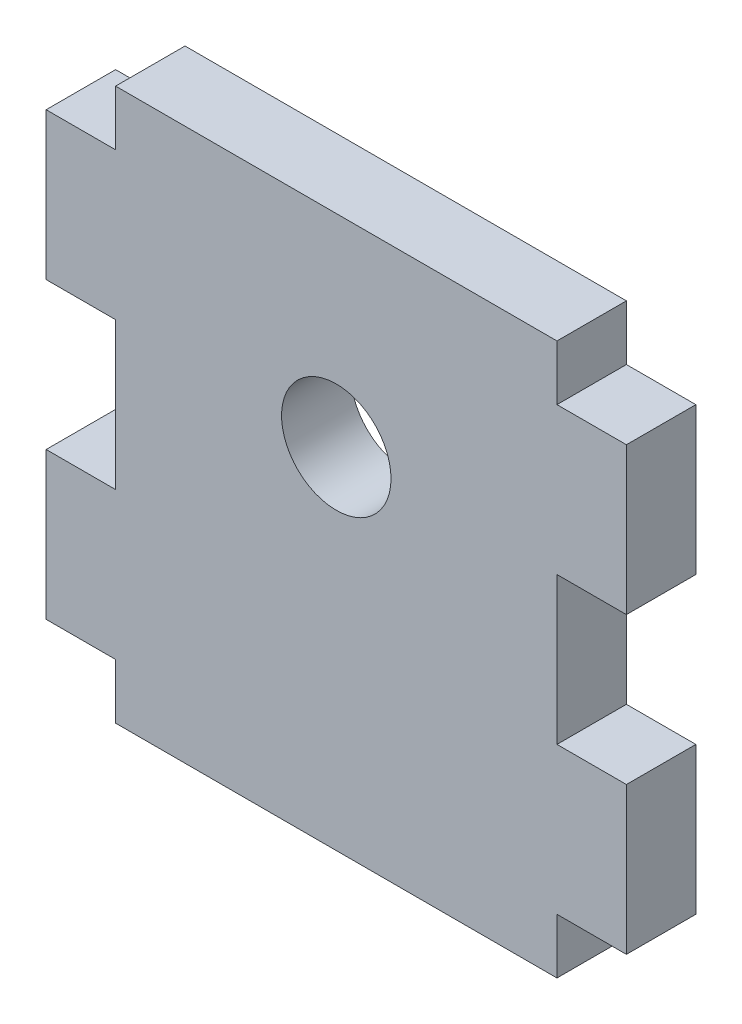
ISO-10303-21;
HEADER;
FILE_DESCRIPTION(('STEP AP214'),'2;1');
FILE_NAME('part.step','',(''),(''),'','','');
FILE_SCHEMA(('AUTOMOTIVE_DESIGN { 1 0 10303 214 1 1 1 1 }'));
ENDSEC;
DATA;
#1=APPLICATION_CONTEXT('core data for automotive mechanical design processes');
#2=APPLICATION_PROTOCOL_DEFINITION('international standard','automotive_design',2000,#1);
#3=PRODUCT_CONTEXT('',#1,'mechanical');
#4=PRODUCT('Part','Part','',(#3));
#5=PRODUCT_RELATED_PRODUCT_CATEGORY('part','',(#4));
#6=PRODUCT_DEFINITION_FORMATION('','',#4);
#7=PRODUCT_DEFINITION_CONTEXT('part definition',#1,'design');
#8=PRODUCT_DEFINITION('design','',#6,#7);
#9=PRODUCT_DEFINITION_SHAPE('','',#8);
#10=(LENGTH_UNIT() NAMED_UNIT(*) SI_UNIT(.MILLI.,.METRE.));
#11=(NAMED_UNIT(*) PLANE_ANGLE_UNIT() SI_UNIT($,.RADIAN.));
#12=(NAMED_UNIT(*) SI_UNIT($,.STERADIAN.) SOLID_ANGLE_UNIT());
#13=UNCERTAINTY_MEASURE_WITH_UNIT(LENGTH_MEASURE(1.E-05),#10,'distance_accuracy_value','');
#14=(GEOMETRIC_REPRESENTATION_CONTEXT(3) GLOBAL_UNCERTAINTY_ASSIGNED_CONTEXT((#13)) GLOBAL_UNIT_ASSIGNED_CONTEXT((#10,
#11,#12)) REPRESENTATION_CONTEXT('',''));
#15=CARTESIAN_POINT('',(0.,0.,0.));
#16=DIRECTION('',(0.,0.,1.));
#17=DIRECTION('',(1.,0.,0.));
#18=AXIS2_PLACEMENT_3D('',#15,#16,#17);
#19=CARTESIAN_POINT('',(0.,0.,5.9944));
#20=DIRECTION('',(-1.,0.,0.));
#21=DIRECTION('',(0.,0.,1.));
#22=AXIS2_PLACEMENT_3D('',#19,#20,#21);
#23=PLANE('',#22);
#24=DIRECTION('',(0.,1.,0.));
#25=VECTOR('',#24,1.);
#26=CARTESIAN_POINT('',(0.,0.,5.9944));
#27=LINE('',#26,#25);
#28=CARTESIAN_POINT('',(0.,1.5875,5.9944));
#29=VERTEX_POINT('',#28);
#30=CARTESIAN_POINT('',(0.,6.35,5.9944));
#31=VERTEX_POINT('',#30);
#32=EDGE_CURVE('E212',#29,#31,#27,.T.);
#33=ORIENTED_EDGE('',*,*,#32,.F.);
#34=DIRECTION('',(0.,0.,1.));
#35=VECTOR('',#34,1.);
#36=CARTESIAN_POINT('',(0.,1.5875,0.));
#37=LINE('',#36,#35);
#38=CARTESIAN_POINT('',(0.,1.5875,0.));
#39=VERTEX_POINT('',#38);
#40=EDGE_CURVE('E328',#39,#29,#37,.T.);
#41=ORIENTED_EDGE('',*,*,#40,.F.);
#42=DIRECTION('',(0.,1.,0.));
#43=VECTOR('',#42,1.);
#44=CARTESIAN_POINT('',(0.,0.,0.));
#45=LINE('',#44,#43);
#46=CARTESIAN_POINT('',(0.,6.35,0.));
#47=VERTEX_POINT('',#46);
#48=EDGE_CURVE('E274',#39,#47,#45,.T.);
#49=ORIENTED_EDGE('',*,*,#48,.T.);
#50=DIRECTION('',(0.,0.,-1.));
#51=VECTOR('',#50,1.);
#52=CARTESIAN_POINT('',(0.,6.35,5.9944));
#53=LINE('',#52,#51);
#54=EDGE_CURVE('E11',#31,#47,#53,.T.);
#55=ORIENTED_EDGE('',*,*,#54,.F.);
#56=EDGE_LOOP('',(#33,#41,#49,#55));
#57=FACE_BOUND('',#56,.T.);
#58=ADVANCED_FACE('F33',(#57),#23,.F.);
#59=CARTESIAN_POINT('',(0.,6.35,5.9944));
#60=DIRECTION('',(0.,1.,0.));
#61=DIRECTION('',(0.,0.,1.));
#62=AXIS2_PLACEMENT_3D('',#59,#60,#61);
#63=PLANE('',#62);
#64=DIRECTION('',(1.,0.,0.));
#65=VECTOR('',#64,1.);
#66=CARTESIAN_POINT('',(0.,6.35,0.));
#67=LINE('',#66,#65);
#68=CARTESIAN_POINT('',(5.99439999999999,6.35,0.));
#69=VERTEX_POINT('',#68);
#70=EDGE_CURVE('E268',#47,#69,#67,.T.);
#71=ORIENTED_EDGE('',*,*,#70,.T.);
#72=DIRECTION('',(0.,0.,-1.));
#73=VECTOR('',#72,1.);
#74=CARTESIAN_POINT('',(5.99439999999999,6.35,5.9944));
#75=LINE('',#74,#73);
#76=CARTESIAN_POINT('',(5.99439999999999,6.35,5.9944));
#77=VERTEX_POINT('',#76);
#78=EDGE_CURVE('E40',#77,#69,#75,.T.);
#79=ORIENTED_EDGE('',*,*,#78,.F.);
#80=DIRECTION('',(1.,0.,0.));
#81=VECTOR('',#80,1.);
#82=CARTESIAN_POINT('',(0.,6.35,5.9944));
#83=LINE('',#82,#81);
#84=EDGE_CURVE('E332',#31,#77,#83,.T.);
#85=ORIENTED_EDGE('',*,*,#84,.F.);
#86=ORIENTED_EDGE('',*,*,#54,.T.);
#87=EDGE_LOOP('',(#71,#79,#85,#86));
#88=FACE_BOUND('',#87,.T.);
#89=ADVANCED_FACE('F359',(#88),#63,.F.);
#90=CARTESIAN_POINT('',(5.99439999999999,6.35,5.9944));
#91=DIRECTION('',(-1.,0.,0.));
#92=DIRECTION('',(0.,0.,1.));
#93=AXIS2_PLACEMENT_3D('',#90,#91,#92);
#94=PLANE('',#93);
#95=DIRECTION('',(0.,1.,0.));
#96=VECTOR('',#95,1.);
#97=CARTESIAN_POINT('',(5.99439999999999,6.35,0.));
#98=LINE('',#97,#96);
#99=CARTESIAN_POINT('',(5.99439999999999,19.05,0.));
#100=VERTEX_POINT('',#99);
#101=EDGE_CURVE('E261',#69,#100,#98,.T.);
#102=ORIENTED_EDGE('',*,*,#101,.T.);
#103=DIRECTION('',(0.,0.,-1.));
#104=VECTOR('',#103,1.);
#105=CARTESIAN_POINT('',(5.99439999999999,19.05,5.9944));
#106=LINE('',#105,#104);
#107=CARTESIAN_POINT('',(5.99439999999999,19.05,5.9944));
#108=VERTEX_POINT('',#107);
#109=EDGE_CURVE('E252',#108,#100,#106,.T.);
#110=ORIENTED_EDGE('',*,*,#109,.F.);
#111=DIRECTION('',(0.,1.,0.));
#112=VECTOR('',#111,1.);
#113=CARTESIAN_POINT('',(5.99439999999999,6.35,5.9944));
#114=LINE('',#113,#112);
#115=EDGE_CURVE('E262',#77,#108,#114,.T.);
#116=ORIENTED_EDGE('',*,*,#115,.F.);
#117=ORIENTED_EDGE('',*,*,#78,.T.);
#118=EDGE_LOOP('',(#102,#110,#116,#117));
#119=FACE_BOUND('',#118,.T.);
#120=ADVANCED_FACE('F259',(#119),#94,.F.);
#121=CARTESIAN_POINT('',(0.,19.05,5.9944));
#122=DIRECTION('',(0.,-1.,0.));
#123=DIRECTION('',(0.,0.,-1.));
#124=AXIS2_PLACEMENT_3D('',#121,#122,#123);
#125=PLANE('',#124);
#126=DIRECTION('',(-1.,0.,0.));
#127=VECTOR('',#126,1.);
#128=CARTESIAN_POINT('',(0.,19.05,0.));
#129=LINE('',#128,#127);
#130=CARTESIAN_POINT('',(0.,19.05,0.));
#131=VERTEX_POINT('',#130);
#132=EDGE_CURVE('E270',#100,#131,#129,.T.);
#133=ORIENTED_EDGE('',*,*,#132,.T.);
#134=DIRECTION('',(0.,0.,-1.));
#135=VECTOR('',#134,1.);
#136=CARTESIAN_POINT('',(0.,19.05,5.9944));
#137=LINE('',#136,#135);
#138=CARTESIAN_POINT('',(0.,19.05,5.9944));
#139=VERTEX_POINT('',#138);
#140=EDGE_CURVE('E249',#139,#131,#137,.T.);
#141=ORIENTED_EDGE('',*,*,#140,.F.);
#142=DIRECTION('',(-1.,0.,0.));
#143=VECTOR('',#142,1.);
#144=CARTESIAN_POINT('',(0.,19.05,5.9944));
#145=LINE('',#144,#143);
#146=EDGE_CURVE('E335',#108,#139,#145,.T.);
#147=ORIENTED_EDGE('',*,*,#146,.F.);
#148=ORIENTED_EDGE('',*,*,#109,.T.);
#149=EDGE_LOOP('',(#133,#141,#147,#148));
#150=FACE_BOUND('',#149,.T.);
#151=ADVANCED_FACE('F356',(#150),#125,.F.);
#152=CARTESIAN_POINT('',(0.,19.05,5.9944));
#153=DIRECTION('',(-1.,0.,0.));
#154=DIRECTION('',(0.,0.,1.));
#155=AXIS2_PLACEMENT_3D('',#152,#153,#154);
#156=PLANE('',#155);
#157=DIRECTION('',(0.,1.,0.));
#158=VECTOR('',#157,1.);
#159=CARTESIAN_POINT('',(0.,19.05,0.));
#160=LINE('',#159,#158);
#161=CARTESIAN_POINT('',(0.,31.75,0.));
#162=VERTEX_POINT('',#161);
#163=EDGE_CURVE('E272',#131,#162,#160,.T.);
#164=ORIENTED_EDGE('',*,*,#163,.T.);
#165=DIRECTION('',(0.,0.,-1.));
#166=VECTOR('',#165,1.);
#167=CARTESIAN_POINT('',(0.,31.75,5.9944));
#168=LINE('',#167,#166);
#169=CARTESIAN_POINT('',(0.,31.75,5.9944));
#170=VERTEX_POINT('',#169);
#171=EDGE_CURVE('E246',#170,#162,#168,.T.);
#172=ORIENTED_EDGE('',*,*,#171,.F.);
#173=DIRECTION('',(0.,1.,0.));
#174=VECTOR('',#173,1.);
#175=CARTESIAN_POINT('',(0.,19.05,5.9944));
#176=LINE('',#175,#174);
#177=EDGE_CURVE('E337',#139,#170,#176,.T.);
#178=ORIENTED_EDGE('',*,*,#177,.F.);
#179=ORIENTED_EDGE('',*,*,#140,.T.);
#180=EDGE_LOOP('',(#164,#172,#178,#179));
#181=FACE_BOUND('',#180,.T.);
#182=ADVANCED_FACE('F352',(#181),#156,.F.);
#183=CARTESIAN_POINT('',(0.,31.75,5.9944));
#184=DIRECTION('',(0.,1.,0.));
#185=DIRECTION('',(0.,0.,1.));
#186=AXIS2_PLACEMENT_3D('',#183,#184,#185);
#187=PLANE('',#186);
#188=DIRECTION('',(1.,0.,0.));
#189=VECTOR('',#188,1.);
#190=CARTESIAN_POINT('',(0.,31.75,0.));
#191=LINE('',#190,#189);
#192=CARTESIAN_POINT('',(5.9944,31.75,0.));
#193=VERTEX_POINT('',#192);
#194=EDGE_CURVE('E279',#162,#193,#191,.T.);
#195=ORIENTED_EDGE('',*,*,#194,.T.);
#196=DIRECTION('',(0.,0.,-1.));
#197=VECTOR('',#196,1.);
#198=CARTESIAN_POINT('',(5.9944,31.75,5.9944));
#199=LINE('',#198,#197);
#200=CARTESIAN_POINT('',(5.9944,31.75,5.9944));
#201=VERTEX_POINT('',#200);
#202=EDGE_CURVE('E243',#201,#193,#199,.T.);
#203=ORIENTED_EDGE('',*,*,#202,.F.);
#204=DIRECTION('',(1.,0.,0.));
#205=VECTOR('',#204,1.);
#206=CARTESIAN_POINT('',(0.,31.75,5.9944));
#207=LINE('',#206,#205);
#208=EDGE_CURVE('E339',#170,#201,#207,.T.);
#209=ORIENTED_EDGE('',*,*,#208,.F.);
#210=ORIENTED_EDGE('',*,*,#171,.T.);
#211=EDGE_LOOP('',(#195,#203,#209,#210));
#212=FACE_BOUND('',#211,.T.);
#213=ADVANCED_FACE('F348',(#212),#187,.F.);
#214=CARTESIAN_POINT('',(5.9944,44.45,5.9944));
#215=DIRECTION('',(-1.,0.,0.));
#216=DIRECTION('',(0.,0.,1.));
#217=AXIS2_PLACEMENT_3D('',#214,#215,#216);
#218=PLANE('',#217);
#219=DIRECTION('',(0.,1.,0.));
#220=VECTOR('',#219,1.);
#221=CARTESIAN_POINT('',(5.9944,44.45,0.));
#222=LINE('',#221,#220);
#223=CARTESIAN_POINT('',(5.9944,44.45,0.));
#224=VERTEX_POINT('',#223);
#225=EDGE_CURVE('E281',#193,#224,#222,.T.);
#226=ORIENTED_EDGE('',*,*,#225,.T.);
#227=DIRECTION('',(0.,0.,-1.));
#228=VECTOR('',#227,1.);
#229=CARTESIAN_POINT('',(5.9944,44.45,5.9944));
#230=LINE('',#229,#228);
#231=CARTESIAN_POINT('',(5.9944,44.45,5.9944));
#232=VERTEX_POINT('',#231);
#233=EDGE_CURVE('E240',#232,#224,#230,.T.);
#234=ORIENTED_EDGE('',*,*,#233,.F.);
#235=DIRECTION('',(0.,1.,0.));
#236=VECTOR('',#235,1.);
#237=CARTESIAN_POINT('',(5.9944,44.45,5.9944));
#238=LINE('',#237,#236);
#239=EDGE_CURVE('E299',#201,#232,#238,.T.);
#240=ORIENTED_EDGE('',*,*,#239,.F.);
#241=ORIENTED_EDGE('',*,*,#202,.T.);
#242=EDGE_LOOP('',(#226,#234,#240,#241));
#243=FACE_BOUND('',#242,.T.);
#244=ADVANCED_FACE('F345',(#243),#218,.F.);
#245=CARTESIAN_POINT('',(0.,44.45,5.9944));
#246=DIRECTION('',(0.,-1.,0.));
#247=DIRECTION('',(0.,0.,-1.));
#248=AXIS2_PLACEMENT_3D('',#245,#246,#247);
#249=PLANE('',#248);
#250=DIRECTION('',(-1.,0.,0.));
#251=VECTOR('',#250,1.);
#252=CARTESIAN_POINT('',(0.,44.45,0.));
#253=LINE('',#252,#251);
#254=CARTESIAN_POINT('',(0.,44.45,0.));
#255=VERTEX_POINT('',#254);
#256=EDGE_CURVE('E194',#224,#255,#253,.T.);
#257=ORIENTED_EDGE('',*,*,#256,.T.);
#258=DIRECTION('',(0.,0.,-1.));
#259=VECTOR('',#258,1.);
#260=CARTESIAN_POINT('',(0.,44.45,5.9944));
#261=LINE('',#260,#259);
#262=CARTESIAN_POINT('',(0.,44.45,5.9944));
#263=VERTEX_POINT('',#262);
#264=EDGE_CURVE('E237',#263,#255,#261,.T.);
#265=ORIENTED_EDGE('',*,*,#264,.F.);
#266=DIRECTION('',(-1.,0.,0.));
#267=VECTOR('',#266,1.);
#268=CARTESIAN_POINT('',(0.,44.45,5.9944));
#269=LINE('',#268,#267);
#270=EDGE_CURVE('E295',#232,#263,#269,.T.);
#271=ORIENTED_EDGE('',*,*,#270,.F.);
#272=ORIENTED_EDGE('',*,*,#233,.T.);
#273=EDGE_LOOP('',(#257,#265,#271,#272));
#274=FACE_BOUND('',#273,.T.);
#275=ADVANCED_FACE('F285',(#274),#249,.F.);
#276=CARTESIAN_POINT('',(0.,44.45,5.9944));
#277=DIRECTION('',(-1.,0.,0.));
#278=DIRECTION('',(0.,0.,1.));
#279=AXIS2_PLACEMENT_3D('',#276,#277,#278);
#280=PLANE('',#279);
#281=DIRECTION('',(0.,1.,0.));
#282=VECTOR('',#281,1.);
#283=CARTESIAN_POINT('',(0.,44.45,0.));
#284=LINE('',#283,#282);
#285=CARTESIAN_POINT('',(0.,49.2125,0.));
#286=VERTEX_POINT('',#285);
#287=EDGE_CURVE('E190',#255,#286,#284,.T.);
#288=ORIENTED_EDGE('',*,*,#287,.T.);
#289=DIRECTION('',(0.,0.,1.));
#290=VECTOR('',#289,1.);
#291=CARTESIAN_POINT('',(0.,49.2125,0.));
#292=LINE('',#291,#290);
#293=CARTESIAN_POINT('',(0.,49.2125,5.9944));
#294=VERTEX_POINT('',#293);
#295=EDGE_CURVE('E47',#286,#294,#292,.T.);
#296=ORIENTED_EDGE('',*,*,#295,.T.);
#297=DIRECTION('',(0.,1.,0.));
#298=VECTOR('',#297,1.);
#299=CARTESIAN_POINT('',(0.,44.45,5.9944));
#300=LINE('',#299,#298);
#301=EDGE_CURVE('E293',#263,#294,#300,.T.);
#302=ORIENTED_EDGE('',*,*,#301,.F.);
#303=ORIENTED_EDGE('',*,*,#264,.T.);
#304=EDGE_LOOP('',(#288,#296,#302,#303));
#305=FACE_BOUND('',#304,.T.);
#306=ADVANCED_FACE('F291',(#305),#280,.F.);
#307=CARTESIAN_POINT('',(-38.1,44.45,5.9944));
#308=DIRECTION('',(1.,0.,0.));
#309=DIRECTION('',(0.,1.,0.));
#310=AXIS2_PLACEMENT_3D('',#307,#308,#309);
#311=PLANE('',#310);
#312=DIRECTION('',(0.,-1.,0.));
#313=VECTOR('',#312,1.);
#314=CARTESIAN_POINT('',(-38.1,44.45,5.9944));
#315=LINE('',#314,#313);
#316=CARTESIAN_POINT('',(-38.1,49.2125,5.9944));
#317=VERTEX_POINT('',#316);
#318=CARTESIAN_POINT('',(-38.1,44.45,5.9944));
#319=VERTEX_POINT('',#318);
#320=EDGE_CURVE('E183',#317,#319,#315,.T.);
#321=ORIENTED_EDGE('',*,*,#320,.F.);
#322=DIRECTION('',(0.,0.,1.));
#323=VECTOR('',#322,1.);
#324=CARTESIAN_POINT('',(-38.1,49.2125,0.));
#325=LINE('',#324,#323);
#326=CARTESIAN_POINT('',(-38.1,49.2125,0.));
#327=VERTEX_POINT('',#326);
#328=EDGE_CURVE('E169',#327,#317,#325,.T.);
#329=ORIENTED_EDGE('',*,*,#328,.F.);
#330=DIRECTION('',(0.,-1.,0.));
#331=VECTOR('',#330,1.);
#332=CARTESIAN_POINT('',(-38.1,44.45,0.));
#333=LINE('',#332,#331);
#334=CARTESIAN_POINT('',(-38.1,44.45,0.));
#335=VERTEX_POINT('',#334);
#336=EDGE_CURVE('E181',#327,#335,#333,.T.);
#337=ORIENTED_EDGE('',*,*,#336,.T.);
#338=DIRECTION('',(0.,0.,-1.));
#339=VECTOR('',#338,1.);
#340=CARTESIAN_POINT('',(-38.1,44.45,5.9944));
#341=LINE('',#340,#339);
#342=EDGE_CURVE('E235',#319,#335,#341,.T.);
#343=ORIENTED_EDGE('',*,*,#342,.F.);
#344=EDGE_LOOP('',(#321,#329,#337,#343));
#345=FACE_BOUND('',#344,.T.);
#346=ADVANCED_FACE('F179',(#345),#311,.F.);
#347=CARTESIAN_POINT('',(-38.1,44.45,5.9944));
#348=DIRECTION('',(0.,-1.,0.));
#349=DIRECTION('',(0.,0.,-1.));
#350=AXIS2_PLACEMENT_3D('',#347,#348,#349);
#351=PLANE('',#350);
#352=DIRECTION('',(-1.,0.,0.));
#353=VECTOR('',#352,1.);
#354=CARTESIAN_POINT('',(-38.1,44.45,0.));
#355=LINE('',#354,#353);
#356=CARTESIAN_POINT('',(-44.0944,44.45,0.));
#357=VERTEX_POINT('',#356);
#358=EDGE_CURVE('E189',#335,#357,#355,.T.);
#359=ORIENTED_EDGE('',*,*,#358,.T.);
#360=DIRECTION('',(0.,0.,-1.));
#361=VECTOR('',#360,1.);
#362=CARTESIAN_POINT('',(-44.0944,44.45,5.9944));
#363=LINE('',#362,#361);
#364=CARTESIAN_POINT('',(-44.0944,44.45,5.9944));
#365=VERTEX_POINT('',#364);
#366=EDGE_CURVE('E232',#365,#357,#363,.T.);
#367=ORIENTED_EDGE('',*,*,#366,.F.);
#368=DIRECTION('',(-1.,0.,0.));
#369=VECTOR('',#368,1.);
#370=CARTESIAN_POINT('',(-38.1,44.45,5.9944));
#371=LINE('',#370,#369);
#372=EDGE_CURVE('E297',#319,#365,#371,.T.);
#373=ORIENTED_EDGE('',*,*,#372,.F.);
#374=ORIENTED_EDGE('',*,*,#342,.T.);
#375=EDGE_LOOP('',(#359,#367,#373,#374));
#376=FACE_BOUND('',#375,.T.);
#377=ADVANCED_FACE('F399',(#376),#351,.F.);
#378=CARTESIAN_POINT('',(-44.0944,44.45,5.9944));
#379=DIRECTION('',(1.,0.,0.));
#380=DIRECTION('',(0.,0.,-1.));
#381=AXIS2_PLACEMENT_3D('',#378,#379,#380);
#382=PLANE('',#381);
#383=DIRECTION('',(0.,-1.,0.));
#384=VECTOR('',#383,1.);
#385=CARTESIAN_POINT('',(-44.0944,44.45,0.));
#386=LINE('',#385,#384);
#387=CARTESIAN_POINT('',(-44.0944,31.75,0.));
#388=VERTEX_POINT('',#387);
#389=EDGE_CURVE('E192',#357,#388,#386,.T.);
#390=ORIENTED_EDGE('',*,*,#389,.T.);
#391=DIRECTION('',(0.,0.,-1.));
#392=VECTOR('',#391,1.);
#393=CARTESIAN_POINT('',(-44.0944,31.75,5.9944));
#394=LINE('',#393,#392);
#395=CARTESIAN_POINT('',(-44.0944,31.75,5.9944));
#396=VERTEX_POINT('',#395);
#397=EDGE_CURVE('E229',#396,#388,#394,.T.);
#398=ORIENTED_EDGE('',*,*,#397,.F.);
#399=DIRECTION('',(0.,-1.,0.));
#400=VECTOR('',#399,1.);
#401=CARTESIAN_POINT('',(-44.0944,44.45,5.9944));
#402=LINE('',#401,#400);
#403=EDGE_CURVE('E304',#365,#396,#402,.T.);
#404=ORIENTED_EDGE('',*,*,#403,.F.);
#405=ORIENTED_EDGE('',*,*,#366,.T.);
#406=EDGE_LOOP('',(#390,#398,#404,#405));
#407=FACE_BOUND('',#406,.T.);
#408=ADVANCED_FACE('F395',(#407),#382,.F.);
#409=CARTESIAN_POINT('',(-38.1,31.75,5.9944));
#410=DIRECTION('',(0.,1.,0.));
#411=DIRECTION('',(0.,0.,1.));
#412=AXIS2_PLACEMENT_3D('',#409,#410,#411);
#413=PLANE('',#412);
#414=DIRECTION('',(1.,0.,0.));
#415=VECTOR('',#414,1.);
#416=CARTESIAN_POINT('',(-38.1,31.75,0.));
#417=LINE('',#416,#415);
#418=CARTESIAN_POINT('',(-38.1,31.75,0.));
#419=VERTEX_POINT('',#418);
#420=EDGE_CURVE('E199',#388,#419,#417,.T.);
#421=ORIENTED_EDGE('',*,*,#420,.T.);
#422=DIRECTION('',(0.,0.,-1.));
#423=VECTOR('',#422,1.);
#424=CARTESIAN_POINT('',(-38.1,31.75,5.9944));
#425=LINE('',#424,#423);
#426=CARTESIAN_POINT('',(-38.1,31.75,5.9944));
#427=VERTEX_POINT('',#426);
#428=EDGE_CURVE('E226',#427,#419,#425,.T.);
#429=ORIENTED_EDGE('',*,*,#428,.F.);
#430=DIRECTION('',(1.,0.,0.));
#431=VECTOR('',#430,1.);
#432=CARTESIAN_POINT('',(-38.1,31.75,5.9944));
#433=LINE('',#432,#431);
#434=EDGE_CURVE('E306',#396,#427,#433,.T.);
#435=ORIENTED_EDGE('',*,*,#434,.F.);
#436=ORIENTED_EDGE('',*,*,#397,.T.);
#437=EDGE_LOOP('',(#421,#429,#435,#436));
#438=FACE_BOUND('',#437,.T.);
#439=ADVANCED_FACE('F390',(#438),#413,.F.);
#440=CARTESIAN_POINT('',(-38.1,19.05,5.9944));
#441=DIRECTION('',(1.,0.,0.));
#442=DIRECTION('',(0.,0.,-1.));
#443=AXIS2_PLACEMENT_3D('',#440,#441,#442);
#444=PLANE('',#443);
#445=DIRECTION('',(0.,-1.,0.));
#446=VECTOR('',#445,1.);
#447=CARTESIAN_POINT('',(-38.1,19.05,0.));
#448=LINE('',#447,#446);
#449=CARTESIAN_POINT('',(-38.1,19.05,0.));
#450=VERTEX_POINT('',#449);
#451=EDGE_CURVE('E201',#419,#450,#448,.T.);
#452=ORIENTED_EDGE('',*,*,#451,.T.);
#453=DIRECTION('',(0.,0.,-1.));
#454=VECTOR('',#453,1.);
#455=CARTESIAN_POINT('',(-38.1,19.05,5.9944));
#456=LINE('',#455,#454);
#457=CARTESIAN_POINT('',(-38.1,19.05,5.9944));
#458=VERTEX_POINT('',#457);
#459=EDGE_CURVE('E223',#458,#450,#456,.T.);
#460=ORIENTED_EDGE('',*,*,#459,.F.);
#461=DIRECTION('',(0.,-1.,0.));
#462=VECTOR('',#461,1.);
#463=CARTESIAN_POINT('',(-38.1,19.05,5.9944));
#464=LINE('',#463,#462);
#465=EDGE_CURVE('E308',#427,#458,#464,.T.);
#466=ORIENTED_EDGE('',*,*,#465,.F.);
#467=ORIENTED_EDGE('',*,*,#428,.T.);
#468=EDGE_LOOP('',(#452,#460,#466,#467));
#469=FACE_BOUND('',#468,.T.);
#470=ADVANCED_FACE('F386',(#469),#444,.F.);
#471=CARTESIAN_POINT('',(-38.1,19.05,5.9944));
#472=DIRECTION('',(0.,-1.,0.));
#473=DIRECTION('',(0.,0.,-1.));
#474=AXIS2_PLACEMENT_3D('',#471,#472,#473);
#475=PLANE('',#474);
#476=DIRECTION('',(-1.,0.,0.));
#477=VECTOR('',#476,1.);
#478=CARTESIAN_POINT('',(-38.1,19.05,0.));
#479=LINE('',#478,#477);
#480=CARTESIAN_POINT('',(-44.0944,19.05,0.));
#481=VERTEX_POINT('',#480);
#482=EDGE_CURVE('E203',#450,#481,#479,.T.);
#483=ORIENTED_EDGE('',*,*,#482,.T.);
#484=DIRECTION('',(0.,0.,-1.));
#485=VECTOR('',#484,1.);
#486=CARTESIAN_POINT('',(-44.0944,19.05,5.9944));
#487=LINE('',#486,#485);
#488=CARTESIAN_POINT('',(-44.0944,19.05,5.9944));
#489=VERTEX_POINT('',#488);
#490=EDGE_CURVE('E220',#489,#481,#487,.T.);
#491=ORIENTED_EDGE('',*,*,#490,.F.);
#492=DIRECTION('',(-1.,0.,0.));
#493=VECTOR('',#492,1.);
#494=CARTESIAN_POINT('',(-38.1,19.05,5.9944));
#495=LINE('',#494,#493);
#496=EDGE_CURVE('E310',#458,#489,#495,.T.);
#497=ORIENTED_EDGE('',*,*,#496,.F.);
#498=ORIENTED_EDGE('',*,*,#459,.T.);
#499=EDGE_LOOP('',(#483,#491,#497,#498));
#500=FACE_BOUND('',#499,.T.);
#501=ADVANCED_FACE('F382',(#500),#475,.F.);
#502=CARTESIAN_POINT('',(-44.0944,6.35,5.9944));
#503=DIRECTION('',(1.,0.,0.));
#504=DIRECTION('',(0.,0.,-1.));
#505=AXIS2_PLACEMENT_3D('',#502,#503,#504);
#506=PLANE('',#505);
#507=DIRECTION('',(0.,-1.,0.));
#508=VECTOR('',#507,1.);
#509=CARTESIAN_POINT('',(-44.0944,6.35,0.));
#510=LINE('',#509,#508);
#511=CARTESIAN_POINT('',(-44.0944,6.35,0.));
#512=VERTEX_POINT('',#511);
#513=EDGE_CURVE('E205',#481,#512,#510,.T.);
#514=ORIENTED_EDGE('',*,*,#513,.T.);
#515=DIRECTION('',(0.,0.,-1.));
#516=VECTOR('',#515,1.);
#517=CARTESIAN_POINT('',(-44.0944,6.35,5.9944));
#518=LINE('',#517,#516);
#519=CARTESIAN_POINT('',(-44.0944,6.35,5.9944));
#520=VERTEX_POINT('',#519);
#521=EDGE_CURVE('E216',#520,#512,#518,.T.);
#522=ORIENTED_EDGE('',*,*,#521,.F.);
#523=DIRECTION('',(0.,-1.,0.));
#524=VECTOR('',#523,1.);
#525=CARTESIAN_POINT('',(-44.0944,6.35,5.9944));
#526=LINE('',#525,#524);
#527=EDGE_CURVE('E312',#489,#520,#526,.T.);
#528=ORIENTED_EDGE('',*,*,#527,.F.);
#529=ORIENTED_EDGE('',*,*,#490,.T.);
#530=EDGE_LOOP('',(#514,#522,#528,#529));
#531=FACE_BOUND('',#530,.T.);
#532=ADVANCED_FACE('F377',(#531),#506,.F.);
#533=CARTESIAN_POINT('',(-38.1,6.35,5.9944));
#534=DIRECTION('',(0.,1.,0.));
#535=DIRECTION('',(0.,0.,1.));
#536=AXIS2_PLACEMENT_3D('',#533,#534,#535);
#537=PLANE('',#536);
#538=DIRECTION('',(1.,0.,0.));
#539=VECTOR('',#538,1.);
#540=CARTESIAN_POINT('',(-38.1,6.35,0.));
#541=LINE('',#540,#539);
#542=CARTESIAN_POINT('',(-38.1,6.35,0.));
#543=VERTEX_POINT('',#542);
#544=EDGE_CURVE('E207',#512,#543,#541,.T.);
#545=ORIENTED_EDGE('',*,*,#544,.T.);
#546=DIRECTION('',(0.,0.,-1.));
#547=VECTOR('',#546,1.);
#548=CARTESIAN_POINT('',(-38.1,6.35,5.9944));
#549=LINE('',#548,#547);
#550=CARTESIAN_POINT('',(-38.1,6.35,5.9944));
#551=VERTEX_POINT('',#550);
#552=EDGE_CURVE('E213',#551,#543,#549,.T.);
#553=ORIENTED_EDGE('',*,*,#552,.F.);
#554=DIRECTION('',(1.,0.,0.));
#555=VECTOR('',#554,1.);
#556=CARTESIAN_POINT('',(-38.1,6.35,5.9944));
#557=LINE('',#556,#555);
#558=EDGE_CURVE('E314',#520,#551,#557,.T.);
#559=ORIENTED_EDGE('',*,*,#558,.F.);
#560=ORIENTED_EDGE('',*,*,#521,.T.);
#561=EDGE_LOOP('',(#545,#553,#559,#560));
#562=FACE_BOUND('',#561,.T.);
#563=ADVANCED_FACE('F371',(#562),#537,.F.);
#564=CARTESIAN_POINT('',(-38.1,0.,5.9944));
#565=DIRECTION('',(1.,0.,0.));
#566=DIRECTION('',(0.,1.,0.));
#567=AXIS2_PLACEMENT_3D('',#564,#565,#566);
#568=PLANE('',#567);
#569=DIRECTION('',(0.,-1.,0.));
#570=VECTOR('',#569,1.);
#571=CARTESIAN_POINT('',(-38.1,0.,0.));
#572=LINE('',#571,#570);
#573=CARTESIAN_POINT('',(-38.1,1.5875,0.));
#574=VERTEX_POINT('',#573);
#575=EDGE_CURVE('E209',#543,#574,#572,.T.);
#576=ORIENTED_EDGE('',*,*,#575,.T.);
#577=DIRECTION('',(0.,0.,1.));
#578=VECTOR('',#577,1.);
#579=CARTESIAN_POINT('',(-38.1,1.5875,0.));
#580=LINE('',#579,#578);
#581=CARTESIAN_POINT('',(-38.1,1.5875,5.9944));
#582=VERTEX_POINT('',#581);
#583=EDGE_CURVE('E55',#574,#582,#580,.T.);
#584=ORIENTED_EDGE('',*,*,#583,.T.);
#585=DIRECTION('',(0.,-1.,0.));
#586=VECTOR('',#585,1.);
#587=CARTESIAN_POINT('',(-38.1,0.,5.9944));
#588=LINE('',#587,#586);
#589=EDGE_CURVE('E217',#551,#582,#588,.T.);
#590=ORIENTED_EDGE('',*,*,#589,.F.);
#591=ORIENTED_EDGE('',*,*,#552,.T.);
#592=EDGE_LOOP('',(#576,#584,#590,#591));
#593=FACE_BOUND('',#592,.T.);
#594=ADVANCED_FACE('F366',(#593),#568,.F.);
#595=CARTESIAN_POINT('',(0.,0.,5.9944));
#596=DIRECTION('',(0.,0.,-1.));
#597=DIRECTION('',(-1.,0.,0.));
#598=AXIS2_PLACEMENT_3D('',#595,#596,#597);
#599=PLANE('',#598);
#600=CARTESIAN_POINT('',(-19.05,31.75,5.9944));
#601=DIRECTION('',(0.,0.,1.));
#602=DIRECTION('',(1.,0.,0.));
#603=AXIS2_PLACEMENT_3D('',#600,#601,#602);
#604=CIRCLE('',#603,4.7244);
#605=CARTESIAN_POINT('',(-14.3256,31.75,5.9944));
#606=VERTEX_POINT('',#605);
#607=EDGE_CURVE('E322',#606,#606,#604,.T.);
#608=ORIENTED_EDGE('',*,*,#607,.F.);
#609=EDGE_LOOP('',(#608));
#610=FACE_BOUND('',#609,.T.);
#611=ORIENTED_EDGE('',*,*,#301,.T.);
#612=DIRECTION('',(1.,0.,0.));
#613=VECTOR('',#612,1.);
#614=CARTESIAN_POINT('',(0.,49.2125,5.9944));
#615=LINE('',#614,#613);
#616=EDGE_CURVE('E175',#317,#294,#615,.T.);
#617=ORIENTED_EDGE('',*,*,#616,.F.);
#618=ORIENTED_EDGE('',*,*,#320,.T.);
#619=ORIENTED_EDGE('',*,*,#372,.T.);
#620=ORIENTED_EDGE('',*,*,#403,.T.);
#621=ORIENTED_EDGE('',*,*,#434,.T.);
#622=ORIENTED_EDGE('',*,*,#465,.T.);
#623=ORIENTED_EDGE('',*,*,#496,.T.);
#624=ORIENTED_EDGE('',*,*,#527,.T.);
#625=ORIENTED_EDGE('',*,*,#558,.T.);
#626=ORIENTED_EDGE('',*,*,#589,.T.);
#627=DIRECTION('',(-1.,0.,0.));
#628=VECTOR('',#627,1.);
#629=CARTESIAN_POINT('',(-38.1,1.5875,5.9944));
#630=LINE('',#629,#628);
#631=EDGE_CURVE('E363',#29,#582,#630,.T.);
#632=ORIENTED_EDGE('',*,*,#631,.F.);
#633=ORIENTED_EDGE('',*,*,#32,.T.);
#634=ORIENTED_EDGE('',*,*,#84,.T.);
#635=ORIENTED_EDGE('',*,*,#115,.T.);
#636=ORIENTED_EDGE('',*,*,#146,.T.);
#637=ORIENTED_EDGE('',*,*,#177,.T.);
#638=ORIENTED_EDGE('',*,*,#208,.T.);
#639=ORIENTED_EDGE('',*,*,#239,.T.);
#640=ORIENTED_EDGE('',*,*,#270,.T.);
#641=EDGE_LOOP('',(#611,#617,#618,#619,#620,#621,#622,#623,#624,#625,#626,#632,#633,#634,#635,
#636,#637,#638,#639,#640));
#642=FACE_BOUND('',#641,.T.);
#643=ADVANCED_FACE('F341',(#610,#642),#599,.F.);
#644=CARTESIAN_POINT('',(0.,0.,0.));
#645=DIRECTION('',(0.,0.,-1.));
#646=DIRECTION('',(-1.,0.,0.));
#647=AXIS2_PLACEMENT_3D('',#644,#645,#646);
#648=PLANE('',#647);
#649=DIRECTION('',(1.,0.,0.));
#650=VECTOR('',#649,1.);
#651=CARTESIAN_POINT('',(0.,49.2125,0.));
#652=LINE('',#651,#650);
#653=EDGE_CURVE('E166',#327,#286,#652,.T.);
#654=ORIENTED_EDGE('',*,*,#653,.T.);
#655=ORIENTED_EDGE('',*,*,#287,.F.);
#656=ORIENTED_EDGE('',*,*,#256,.F.);
#657=ORIENTED_EDGE('',*,*,#225,.F.);
#658=ORIENTED_EDGE('',*,*,#194,.F.);
#659=ORIENTED_EDGE('',*,*,#163,.F.);
#660=ORIENTED_EDGE('',*,*,#132,.F.);
#661=ORIENTED_EDGE('',*,*,#101,.F.);
#662=ORIENTED_EDGE('',*,*,#70,.F.);
#663=ORIENTED_EDGE('',*,*,#48,.F.);
#664=DIRECTION('',(-1.,0.,0.));
#665=VECTOR('',#664,1.);
#666=CARTESIAN_POINT('',(-38.1,1.5875,0.));
#667=LINE('',#666,#665);
#668=EDGE_CURVE('E360',#39,#574,#667,.T.);
#669=ORIENTED_EDGE('',*,*,#668,.T.);
#670=ORIENTED_EDGE('',*,*,#575,.F.);
#671=ORIENTED_EDGE('',*,*,#544,.F.);
#672=ORIENTED_EDGE('',*,*,#513,.F.);
#673=ORIENTED_EDGE('',*,*,#482,.F.);
#674=ORIENTED_EDGE('',*,*,#451,.F.);
#675=ORIENTED_EDGE('',*,*,#420,.F.);
#676=ORIENTED_EDGE('',*,*,#389,.F.);
#677=ORIENTED_EDGE('',*,*,#358,.F.);
#678=ORIENTED_EDGE('',*,*,#336,.F.);
#679=EDGE_LOOP('',(#654,#655,#656,#657,#658,#659,#660,#661,#662,#663,#669,#670,#671,#672,#673,
#674,#675,#676,#677,#678));
#680=FACE_BOUND('',#679,.T.);
#681=CARTESIAN_POINT('',(-19.05,31.75,0.));
#682=DIRECTION('',(0.,0.,1.));
#683=DIRECTION('',(1.,0.,0.));
#684=AXIS2_PLACEMENT_3D('',#681,#682,#683);
#685=CIRCLE('',#684,4.7244);
#686=CARTESIAN_POINT('',(-14.3256,31.75,0.));
#687=VERTEX_POINT('',#686);
#688=EDGE_CURVE('E317',#687,#687,#685,.T.);
#689=ORIENTED_EDGE('',*,*,#688,.T.);
#690=EDGE_LOOP('',(#689));
#691=FACE_BOUND('',#690,.T.);
#692=ADVANCED_FACE('F186',(#680,#691),#648,.T.);
#693=CARTESIAN_POINT('',(-19.05,31.75,0.));
#694=DIRECTION('',(0.,0.,1.));
#695=DIRECTION('',(1.,0.,0.));
#696=AXIS2_PLACEMENT_3D('',#693,#694,#695);
#697=CYLINDRICAL_SURFACE('',#696,4.7244);
#698=ORIENTED_EDGE('',*,*,#688,.F.);
#699=EDGE_LOOP('',(#698));
#700=FACE_BOUND('',#699,.T.);
#701=ORIENTED_EDGE('',*,*,#607,.T.);
#702=EDGE_LOOP('',(#701));
#703=FACE_BOUND('',#702,.T.);
#704=ADVANCED_FACE('F405',(#700,#703),#697,.F.);
#705=CARTESIAN_POINT('',(-38.1,1.5875,0.));
#706=DIRECTION('',(0.,1.,0.));
#707=DIRECTION('',(0.,0.,1.));
#708=AXIS2_PLACEMENT_3D('',#705,#706,#707);
#709=PLANE('',#708);
#710=ORIENTED_EDGE('',*,*,#631,.T.);
#711=ORIENTED_EDGE('',*,*,#583,.F.);
#712=ORIENTED_EDGE('',*,*,#668,.F.);
#713=ORIENTED_EDGE('',*,*,#40,.T.);
#714=EDGE_LOOP('',(#710,#711,#712,#713));
#715=FACE_BOUND('',#714,.T.);
#716=ADVANCED_FACE('F403',(#715),#709,.F.);
#717=CARTESIAN_POINT('',(0.,49.2125,0.));
#718=DIRECTION('',(0.,-1.,0.));
#719=DIRECTION('',(1.,0.,0.));
#720=AXIS2_PLACEMENT_3D('',#717,#718,#719);
#721=PLANE('',#720);
#722=ORIENTED_EDGE('',*,*,#616,.T.);
#723=ORIENTED_EDGE('',*,*,#295,.F.);
#724=ORIENTED_EDGE('',*,*,#653,.F.);
#725=ORIENTED_EDGE('',*,*,#328,.T.);
#726=EDGE_LOOP('',(#722,#723,#724,#725));
#727=FACE_BOUND('',#726,.T.);
#728=ADVANCED_FACE('F168',(#727),#721,.F.);
#729=CLOSED_SHELL('',(#58,#89,#120,#151,#182,#213,#244,#275,#306,#346,#377,#408,#439,#470,#501,
#532,#563,#594,#643,#692,#704,#716,#728));
#730=MANIFOLD_SOLID_BREP('B2',#729);
#731=ADVANCED_BREP_SHAPE_REPRESENTATION('',(#18,#730),#14);
#732=SHAPE_DEFINITION_REPRESENTATION(#9,#731);
ENDSEC;
END-ISO-10303-21;
